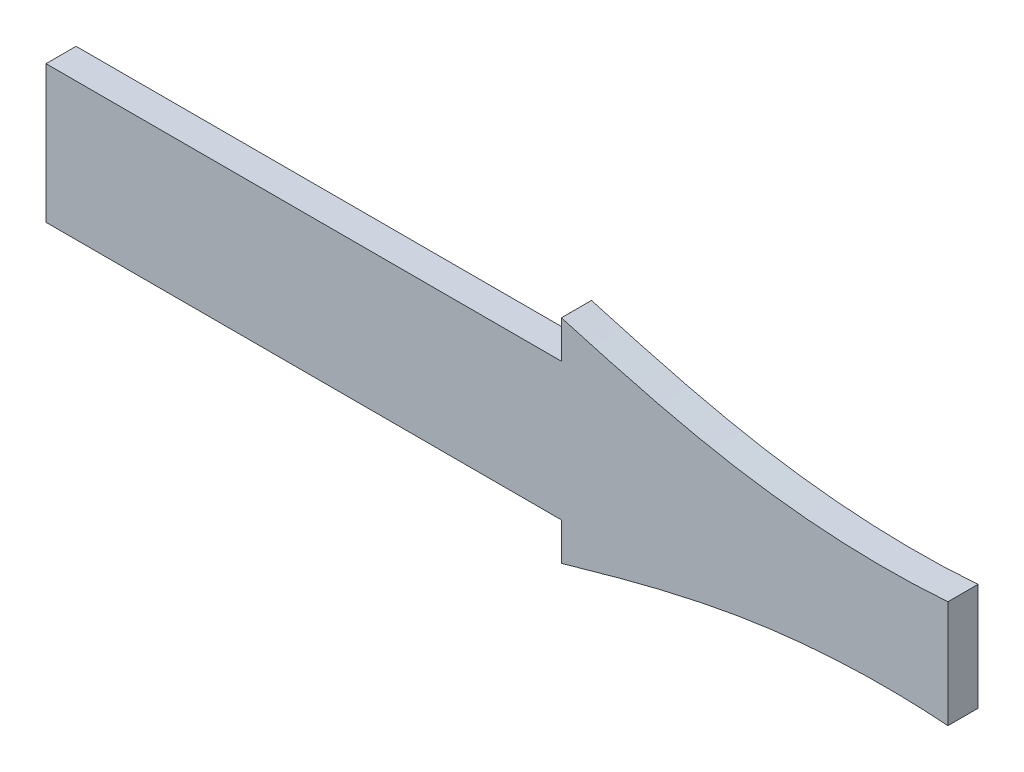
ISO-10303-21;
HEADER;
FILE_DESCRIPTION(('STEP AP214'),'2;1');
FILE_NAME('part.step','',(''),(''),'','','');
FILE_SCHEMA(('AUTOMOTIVE_DESIGN { 1 0 10303 214 1 1 1 1 }'));
ENDSEC;
DATA;
#1=APPLICATION_CONTEXT('core data for automotive mechanical design processes');
#2=APPLICATION_PROTOCOL_DEFINITION('international standard','automotive_design',2000,#1);
#3=PRODUCT_CONTEXT('',#1,'mechanical');
#4=PRODUCT('Part','Part','',(#3));
#5=PRODUCT_RELATED_PRODUCT_CATEGORY('part','',(#4));
#6=PRODUCT_DEFINITION_FORMATION('','',#4);
#7=PRODUCT_DEFINITION_CONTEXT('part definition',#1,'design');
#8=PRODUCT_DEFINITION('design','',#6,#7);
#9=PRODUCT_DEFINITION_SHAPE('','',#8);
#10=(LENGTH_UNIT() NAMED_UNIT(*) SI_UNIT(.MILLI.,.METRE.));
#11=(NAMED_UNIT(*) PLANE_ANGLE_UNIT() SI_UNIT($,.RADIAN.));
#12=(NAMED_UNIT(*) SI_UNIT($,.STERADIAN.) SOLID_ANGLE_UNIT());
#13=UNCERTAINTY_MEASURE_WITH_UNIT(LENGTH_MEASURE(1.E-05),#10,'distance_accuracy_value','');
#14=(GEOMETRIC_REPRESENTATION_CONTEXT(3) GLOBAL_UNCERTAINTY_ASSIGNED_CONTEXT((#13)) GLOBAL_UNIT_ASSIGNED_CONTEXT((#10,
#11,#12)) REPRESENTATION_CONTEXT('',''));
#15=CARTESIAN_POINT('',(0.,0.,0.));
#16=DIRECTION('',(0.,0.,1.));
#17=DIRECTION('',(1.,0.,0.));
#18=AXIS2_PLACEMENT_3D('',#15,#16,#17);
#19=CARTESIAN_POINT('',(211.080761054354,-14.1372436297702,4.));
#20=CARTESIAN_POINT('',(211.917848379137,-13.8968761496012,4.));
#21=CARTESIAN_POINT('',(219.460294722886,-11.7453356385952,4.));
#22=CARTESIAN_POINT('',(236.298901931766,-7.32725703188995,4.));
#23=CARTESIAN_POINT('',(252.970465499473,-6.41422732677675,4.));
#24=CARTESIAN_POINT('',(262.480297025179,-7.138824440415,4.));
#25=B_SPLINE_CURVE_WITH_KNOTS('',3,(#19,#20,#21,#22,#23,#24),.UNSPECIFIED.,.F.,.F.,(4,1,1,4),
(0.460880266575432,0.487879211232111,0.704009033424454,1.),.UNSPECIFIED.);
#26=DIRECTION('',(0.,0.,-1.));
#27=VECTOR('',#26,1.);
#28=SURFACE_OF_LINEAR_EXTRUSION('',#25,#27);
#29=CARTESIAN_POINT('',(211.080761054354,-14.1372436297702,0.));
#30=CARTESIAN_POINT('',(211.917848379137,-13.8968761496012,0.));
#31=CARTESIAN_POINT('',(219.460294722886,-11.7453356385952,0.));
#32=CARTESIAN_POINT('',(236.298901931766,-7.32725703188995,0.));
#33=CARTESIAN_POINT('',(252.970465499473,-6.41422732677675,0.));
#34=CARTESIAN_POINT('',(262.480297025179,-7.138824440415,0.));
#35=B_SPLINE_CURVE_WITH_KNOTS('',3,(#29,#30,#31,#32,#33,#34),.UNSPECIFIED.,.F.,.F.,(4,1,1,4),
(0.460880266575432,0.487879211232111,0.704009033424454,1.),.UNSPECIFIED.);
#36=CARTESIAN_POINT('',(211.080761054354,-14.1372436297702,0.));
#37=VERTEX_POINT('',#36);
#38=CARTESIAN_POINT('',(262.480297025179,-7.138824440415,0.));
#39=VERTEX_POINT('',#38);
#40=EDGE_CURVE('E141',#37,#39,#35,.T.);
#41=ORIENTED_EDGE('',*,*,#40,.T.);
#42=DIRECTION('',(0.,0.,-1.));
#43=VECTOR('',#42,1.);
#44=CARTESIAN_POINT('',(262.480297025179,-7.138824440415,4.));
#45=LINE('',#44,#43);
#46=CARTESIAN_POINT('',(262.480297025179,-7.138824440415,4.));
#47=VERTEX_POINT('',#46);
#48=EDGE_CURVE('E11',#47,#39,#45,.T.);
#49=ORIENTED_EDGE('',*,*,#48,.F.);
#50=CARTESIAN_POINT('',(211.080761054354,-14.1372436297702,4.));
#51=VERTEX_POINT('',#50);
#52=EDGE_CURVE('E173',#51,#47,#25,.T.);
#53=ORIENTED_EDGE('',*,*,#52,.F.);
#54=DIRECTION('',(0.,0.,-1.));
#55=VECTOR('',#54,1.);
#56=CARTESIAN_POINT('',(211.080761054354,-14.1372436297702,4.));
#57=LINE('',#56,#55);
#58=EDGE_CURVE('E137',#51,#37,#57,.T.);
#59=ORIENTED_EDGE('',*,*,#58,.T.);
#60=EDGE_LOOP('',(#41,#49,#53,#59));
#61=FACE_BOUND('',#60,.T.);
#62=ADVANCED_FACE('F39',(#61),#28,.F.);
#63=CARTESIAN_POINT('',(262.480297025179,7.138824440415,4.));
#64=DIRECTION('',(-1.,0.,0.));
#65=DIRECTION('',(0.,0.,1.));
#66=AXIS2_PLACEMENT_3D('',#63,#64,#65);
#67=PLANE('',#66);
#68=DIRECTION('',(0.,1.,0.));
#69=VECTOR('',#68,1.);
#70=CARTESIAN_POINT('',(262.480297025179,7.138824440415,0.));
#71=LINE('',#70,#69);
#72=CARTESIAN_POINT('',(262.480297025179,7.138824440415,0.));
#73=VERTEX_POINT('',#72);
#74=EDGE_CURVE('E147',#39,#73,#71,.T.);
#75=ORIENTED_EDGE('',*,*,#74,.T.);
#76=DIRECTION('',(0.,0.,-1.));
#77=VECTOR('',#76,1.);
#78=CARTESIAN_POINT('',(262.480297025179,7.138824440415,4.));
#79=LINE('',#78,#77);
#80=CARTESIAN_POINT('',(262.480297025179,7.138824440415,4.));
#81=VERTEX_POINT('',#80);
#82=EDGE_CURVE('E49',#81,#73,#79,.T.);
#83=ORIENTED_EDGE('',*,*,#82,.F.);
#84=DIRECTION('',(0.,1.,0.));
#85=VECTOR('',#84,1.);
#86=CARTESIAN_POINT('',(262.480297025179,7.138824440415,4.));
#87=LINE('',#86,#85);
#88=EDGE_CURVE('E100',#47,#81,#87,.T.);
#89=ORIENTED_EDGE('',*,*,#88,.F.);
#90=ORIENTED_EDGE('',*,*,#48,.T.);
#91=EDGE_LOOP('',(#75,#83,#89,#90));
#92=FACE_BOUND('',#91,.T.);
#93=ADVANCED_FACE('F222',(#92),#67,.F.);
#94=CARTESIAN_POINT('',(262.480297025179,7.138824440415,4.));
#95=CARTESIAN_POINT('',(252.970465499418,6.41422732679266,4.));
#96=CARTESIAN_POINT('',(236.29890193219,7.32725703176807,4.));
#97=CARTESIAN_POINT('',(219.460294722187,11.7453356387944,4.));
#98=CARTESIAN_POINT('',(211.917848379191,13.8968761495853,4.));
#99=CARTESIAN_POINT('',(211.080761054354,14.1372436297702,4.));
#100=B_SPLINE_CURVE_WITH_KNOTS('',3,(#94,#95,#96,#97,#98,#99),.UNSPECIFIED.,.F.,.F.,(4,1,1,4),
(0.460880266573675,0.756871233149222,0.973001055341564,1.),.UNSPECIFIED.);
#101=DIRECTION('',(0.,0.,-1.));
#102=VECTOR('',#101,1.);
#103=SURFACE_OF_LINEAR_EXTRUSION('',#100,#102);
#104=CARTESIAN_POINT('',(262.480297025179,7.138824440415,0.));
#105=CARTESIAN_POINT('',(252.970465499418,6.41422732679266,0.));
#106=CARTESIAN_POINT('',(236.29890193219,7.32725703176807,0.));
#107=CARTESIAN_POINT('',(219.460294722187,11.7453356387944,0.));
#108=CARTESIAN_POINT('',(211.917848379191,13.8968761495853,0.));
#109=CARTESIAN_POINT('',(211.080761054354,14.1372436297702,0.));
#110=B_SPLINE_CURVE_WITH_KNOTS('',3,(#104,#105,#106,#107,#108,#109),.UNSPECIFIED.,.F.,.F.,(4,1,
1,4),(0.460880266573675,0.756871233149222,0.973001055341564,1.),.UNSPECIFIED.);
#111=CARTESIAN_POINT('',(211.080761054354,14.1372436297702,0.));
#112=VERTEX_POINT('',#111);
#113=EDGE_CURVE('E153',#73,#112,#110,.T.);
#114=ORIENTED_EDGE('',*,*,#113,.T.);
#115=DIRECTION('',(0.,0.,-1.));
#116=VECTOR('',#115,1.);
#117=CARTESIAN_POINT('',(211.080761054354,14.1372436297702,4.));
#118=LINE('',#117,#116);
#119=CARTESIAN_POINT('',(211.080761054354,14.1372436297702,4.));
#120=VERTEX_POINT('',#119);
#121=EDGE_CURVE('E184',#120,#112,#118,.T.);
#122=ORIENTED_EDGE('',*,*,#121,.F.);
#123=EDGE_CURVE('E194',#81,#120,#100,.T.);
#124=ORIENTED_EDGE('',*,*,#123,.F.);
#125=ORIENTED_EDGE('',*,*,#82,.T.);
#126=EDGE_LOOP('',(#114,#122,#124,#125));
#127=FACE_BOUND('',#126,.T.);
#128=ADVANCED_FACE('F192',(#127),#103,.F.);
#129=CARTESIAN_POINT('',(211.080761054354,14.1372436297702,4.));
#130=DIRECTION('',(1.,0.,0.));
#131=DIRECTION('',(0.,0.,-1.));
#132=AXIS2_PLACEMENT_3D('',#129,#130,#131);
#133=PLANE('',#132);
#134=DIRECTION('',(0.,-1.,0.));
#135=VECTOR('',#134,1.);
#136=CARTESIAN_POINT('',(211.080761054354,14.1372436297702,0.));
#137=LINE('',#136,#135);
#138=CARTESIAN_POINT('',(211.080761054354,9.13724362977021,0.));
#139=VERTEX_POINT('',#138);
#140=EDGE_CURVE('E158',#112,#139,#137,.T.);
#141=ORIENTED_EDGE('',*,*,#140,.T.);
#142=DIRECTION('',(0.,0.,-1.));
#143=VECTOR('',#142,1.);
#144=CARTESIAN_POINT('',(211.080761054354,9.13724362977021,4.));
#145=LINE('',#144,#143);
#146=CARTESIAN_POINT('',(211.080761054354,9.13724362977021,4.));
#147=VERTEX_POINT('',#146);
#148=EDGE_CURVE('E180',#147,#139,#145,.T.);
#149=ORIENTED_EDGE('',*,*,#148,.F.);
#150=DIRECTION('',(0.,-1.,0.));
#151=VECTOR('',#150,1.);
#152=CARTESIAN_POINT('',(211.080761054354,14.1372436297702,4.));
#153=LINE('',#152,#151);
#154=EDGE_CURVE('E207',#120,#147,#153,.T.);
#155=ORIENTED_EDGE('',*,*,#154,.F.);
#156=ORIENTED_EDGE('',*,*,#121,.T.);
#157=EDGE_LOOP('',(#141,#149,#155,#156));
#158=FACE_BOUND('',#157,.T.);
#159=ADVANCED_FACE('F202',(#158),#133,.F.);
#160=CARTESIAN_POINT('',(211.080761054354,9.13724362977021,4.));
#161=DIRECTION('',(0.,-1.,0.));
#162=DIRECTION('',(0.,0.,-1.));
#163=AXIS2_PLACEMENT_3D('',#160,#161,#162);
#164=PLANE('',#163);
#165=DIRECTION('',(-1.,0.,0.));
#166=VECTOR('',#165,1.);
#167=CARTESIAN_POINT('',(211.080761054354,9.13724362977021,0.));
#168=LINE('',#167,#166);
#169=CARTESIAN_POINT('',(142.548046426207,9.13724362977021,0.));
#170=VERTEX_POINT('',#169);
#171=EDGE_CURVE('E164',#139,#170,#168,.T.);
#172=ORIENTED_EDGE('',*,*,#171,.T.);
#173=DIRECTION('',(0.,0.,-1.));
#174=VECTOR('',#173,1.);
#175=CARTESIAN_POINT('',(142.548046426207,9.13724362977021,4.));
#176=LINE('',#175,#174);
#177=CARTESIAN_POINT('',(142.548046426207,9.13724362977021,4.));
#178=VERTEX_POINT('',#177);
#179=EDGE_CURVE('E130',#178,#170,#176,.T.);
#180=ORIENTED_EDGE('',*,*,#179,.F.);
#181=DIRECTION('',(-1.,0.,0.));
#182=VECTOR('',#181,1.);
#183=CARTESIAN_POINT('',(211.080761054354,9.13724362977021,4.));
#184=LINE('',#183,#182);
#185=EDGE_CURVE('E119',#147,#178,#184,.T.);
#186=ORIENTED_EDGE('',*,*,#185,.F.);
#187=ORIENTED_EDGE('',*,*,#148,.T.);
#188=EDGE_LOOP('',(#172,#180,#186,#187));
#189=FACE_BOUND('',#188,.T.);
#190=ADVANCED_FACE('F205',(#189),#164,.F.);
#191=CARTESIAN_POINT('',(142.548046426207,9.13724362977021,4.));
#192=DIRECTION('',(1.,0.,0.));
#193=DIRECTION('',(0.,1.,0.));
#194=AXIS2_PLACEMENT_3D('',#191,#192,#193);
#195=PLANE('',#194);
#196=DIRECTION('',(0.,-1.,0.));
#197=VECTOR('',#196,1.);
#198=CARTESIAN_POINT('',(142.548046426207,9.13724362977021,0.));
#199=LINE('',#198,#197);
#200=CARTESIAN_POINT('',(142.548046426207,-9.13724362977021,0.));
#201=VERTEX_POINT('',#200);
#202=EDGE_CURVE('E128',#170,#201,#199,.T.);
#203=ORIENTED_EDGE('',*,*,#202,.T.);
#204=DIRECTION('',(0.,0.,-1.));
#205=VECTOR('',#204,1.);
#206=CARTESIAN_POINT('',(142.548046426207,-9.13724362977021,4.));
#207=LINE('',#206,#205);
#208=CARTESIAN_POINT('',(142.548046426207,-9.13724362977021,4.));
#209=VERTEX_POINT('',#208);
#210=EDGE_CURVE('E125',#209,#201,#207,.T.);
#211=ORIENTED_EDGE('',*,*,#210,.F.);
#212=DIRECTION('',(0.,-1.,0.));
#213=VECTOR('',#212,1.);
#214=CARTESIAN_POINT('',(142.548046426207,9.13724362977021,4.));
#215=LINE('',#214,#213);
#216=EDGE_CURVE('E113',#178,#209,#215,.T.);
#217=ORIENTED_EDGE('',*,*,#216,.F.);
#218=ORIENTED_EDGE('',*,*,#179,.T.);
#219=EDGE_LOOP('',(#203,#211,#217,#218));
#220=FACE_BOUND('',#219,.T.);
#221=ADVANCED_FACE('F126',(#220),#195,.F.);
#222=CARTESIAN_POINT('',(211.080761054354,-9.13724362977021,4.));
#223=DIRECTION('',(0.,1.,0.));
#224=DIRECTION('',(0.,0.,1.));
#225=AXIS2_PLACEMENT_3D('',#222,#223,#224);
#226=PLANE('',#225);
#227=DIRECTION('',(1.,0.,0.));
#228=VECTOR('',#227,1.);
#229=CARTESIAN_POINT('',(211.080761054354,-9.13724362977021,0.));
#230=LINE('',#229,#228);
#231=CARTESIAN_POINT('',(211.080761054354,-9.13724362977021,0.));
#232=VERTEX_POINT('',#231);
#233=EDGE_CURVE('E86',#201,#232,#230,.T.);
#234=ORIENTED_EDGE('',*,*,#233,.T.);
#235=DIRECTION('',(0.,0.,-1.));
#236=VECTOR('',#235,1.);
#237=CARTESIAN_POINT('',(211.080761054354,-9.13724362977021,4.));
#238=LINE('',#237,#236);
#239=CARTESIAN_POINT('',(211.080761054354,-9.13724362977021,4.));
#240=VERTEX_POINT('',#239);
#241=EDGE_CURVE('E131',#240,#232,#238,.T.);
#242=ORIENTED_EDGE('',*,*,#241,.F.);
#243=DIRECTION('',(1.,0.,0.));
#244=VECTOR('',#243,1.);
#245=CARTESIAN_POINT('',(211.080761054354,-9.13724362977021,4.));
#246=LINE('',#245,#244);
#247=EDGE_CURVE('E117',#209,#240,#246,.T.);
#248=ORIENTED_EDGE('',*,*,#247,.F.);
#249=ORIENTED_EDGE('',*,*,#210,.T.);
#250=EDGE_LOOP('',(#234,#242,#248,#249));
#251=FACE_BOUND('',#250,.T.);
#252=ADVANCED_FACE('F133',(#251),#226,.F.);
#253=CARTESIAN_POINT('',(211.080761054354,-14.1372436297702,4.));
#254=DIRECTION('',(1.,0.,0.));
#255=DIRECTION('',(0.,1.,0.));
#256=AXIS2_PLACEMENT_3D('',#253,#254,#255);
#257=PLANE('',#256);
#258=DIRECTION('',(0.,-1.,0.));
#259=VECTOR('',#258,1.);
#260=CARTESIAN_POINT('',(211.080761054354,-14.1372436297702,0.));
#261=LINE('',#260,#259);
#262=EDGE_CURVE('E92',#232,#37,#261,.T.);
#263=ORIENTED_EDGE('',*,*,#262,.T.);
#264=ORIENTED_EDGE('',*,*,#58,.F.);
#265=DIRECTION('',(0.,-1.,0.));
#266=VECTOR('',#265,1.);
#267=CARTESIAN_POINT('',(211.080761054354,-14.1372436297702,4.));
#268=LINE('',#267,#266);
#269=EDGE_CURVE('E57',#240,#51,#268,.T.);
#270=ORIENTED_EDGE('',*,*,#269,.F.);
#271=ORIENTED_EDGE('',*,*,#241,.T.);
#272=EDGE_LOOP('',(#263,#264,#270,#271));
#273=FACE_BOUND('',#272,.T.);
#274=ADVANCED_FACE('F231',(#273),#257,.F.);
#275=CARTESIAN_POINT('',(236.45094904991,-8.15771010345244,4.));
#276=DIRECTION('',(0.,0.,1.));
#277=DIRECTION('',(1.,0.,0.));
#278=AXIS2_PLACEMENT_3D('',#275,#276,#277);
#279=PLANE('',#278);
#280=ORIENTED_EDGE('',*,*,#52,.T.);
#281=ORIENTED_EDGE('',*,*,#88,.T.);
#282=ORIENTED_EDGE('',*,*,#123,.T.);
#283=ORIENTED_EDGE('',*,*,#154,.T.);
#284=ORIENTED_EDGE('',*,*,#185,.T.);
#285=ORIENTED_EDGE('',*,*,#216,.T.);
#286=ORIENTED_EDGE('',*,*,#247,.T.);
#287=ORIENTED_EDGE('',*,*,#269,.T.);
#288=EDGE_LOOP('',(#280,#281,#282,#283,#284,#285,#286,#287));
#289=FACE_BOUND('',#288,.T.);
#290=ADVANCED_FACE('F115',(#289),#279,.T.);
#291=CARTESIAN_POINT('',(236.45094904991,-8.15771010345244,0.));
#292=DIRECTION('',(0.,0.,1.));
#293=DIRECTION('',(1.,0.,0.));
#294=AXIS2_PLACEMENT_3D('',#291,#292,#293);
#295=PLANE('',#294);
#296=ORIENTED_EDGE('',*,*,#40,.F.);
#297=ORIENTED_EDGE('',*,*,#262,.F.);
#298=ORIENTED_EDGE('',*,*,#233,.F.);
#299=ORIENTED_EDGE('',*,*,#202,.F.);
#300=ORIENTED_EDGE('',*,*,#171,.F.);
#301=ORIENTED_EDGE('',*,*,#140,.F.);
#302=ORIENTED_EDGE('',*,*,#113,.F.);
#303=ORIENTED_EDGE('',*,*,#74,.F.);
#304=EDGE_LOOP('',(#296,#297,#298,#299,#300,#301,#302,#303));
#305=FACE_BOUND('',#304,.T.);
#306=ADVANCED_FACE('F198',(#305),#295,.F.);
#307=CLOSED_SHELL('',(#62,#93,#128,#159,#190,#221,#252,#274,#290,#306));
#308=MANIFOLD_SOLID_BREP('B2',#307);
#309=ADVANCED_BREP_SHAPE_REPRESENTATION('',(#18,#308),#14);
#310=SHAPE_DEFINITION_REPRESENTATION(#9,#309);
ENDSEC;
END-ISO-10303-21;
